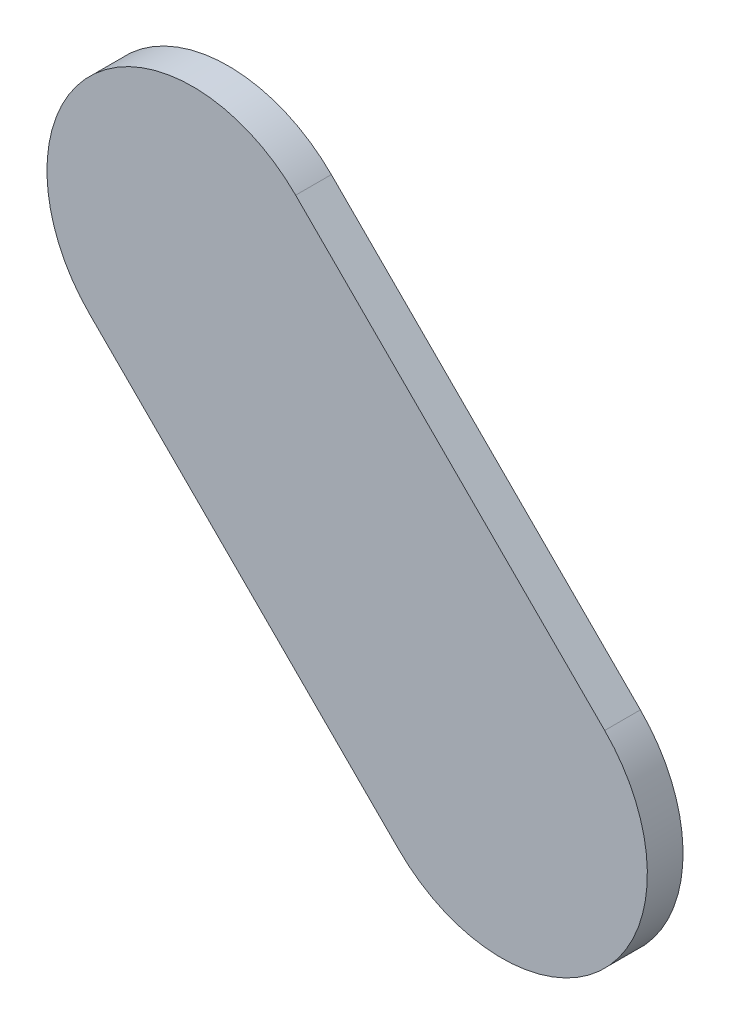
ISO-10303-21;
HEADER;
FILE_DESCRIPTION(('STEP AP214'),'2;1');
FILE_NAME('part.step','',(''),(''),'','','');
FILE_SCHEMA(('AUTOMOTIVE_DESIGN { 1 0 10303 214 1 1 1 1 }'));
ENDSEC;
DATA;
#1=APPLICATION_CONTEXT('core data for automotive mechanical design processes');
#2=APPLICATION_PROTOCOL_DEFINITION('international standard','automotive_design',2000,#1);
#3=PRODUCT_CONTEXT('',#1,'mechanical');
#4=PRODUCT('Part','Part','',(#3));
#5=PRODUCT_RELATED_PRODUCT_CATEGORY('part','',(#4));
#6=PRODUCT_DEFINITION_FORMATION('','',#4);
#7=PRODUCT_DEFINITION_CONTEXT('part definition',#1,'design');
#8=PRODUCT_DEFINITION('design','',#6,#7);
#9=PRODUCT_DEFINITION_SHAPE('','',#8);
#10=(LENGTH_UNIT() NAMED_UNIT(*) SI_UNIT(.MILLI.,.METRE.));
#11=(NAMED_UNIT(*) PLANE_ANGLE_UNIT() SI_UNIT($,.RADIAN.));
#12=(NAMED_UNIT(*) SI_UNIT($,.STERADIAN.) SOLID_ANGLE_UNIT());
#13=UNCERTAINTY_MEASURE_WITH_UNIT(LENGTH_MEASURE(1.E-05),#10,'distance_accuracy_value','');
#14=(GEOMETRIC_REPRESENTATION_CONTEXT(3) GLOBAL_UNCERTAINTY_ASSIGNED_CONTEXT((#13)) GLOBAL_UNIT_ASSIGNED_CONTEXT((#10,
#11,#12)) REPRESENTATION_CONTEXT('',''));
#15=CARTESIAN_POINT('',(0.,0.,0.));
#16=DIRECTION('',(0.,0.,1.));
#17=DIRECTION('',(1.,0.,0.));
#18=AXIS2_PLACEMENT_3D('',#15,#16,#17);
#19=CARTESIAN_POINT('',(7.897858999428,4.213768039131,0.76487));
#20=DIRECTION('',(0.,0.,-1.));
#21=DIRECTION('',(-1.,0.,0.));
#22=AXIS2_PLACEMENT_3D('',#19,#20,#21);
#23=PLANE('',#22);
#24=DIRECTION('',(0.707105987136602,-0.707107575235602,0.));
#25=VECTOR('',#24,1.);
#26=CARTESIAN_POINT('',(7.848468334001,4.460629667,0.76487));
#27=LINE('',#26,#25);
#28=CARTESIAN_POINT('',(7.84846836426741,4.4606296367336,0.76487));
#29=VERTEX_POINT('',#28);
#30=CARTESIAN_POINT('',(8.14545288933316,4.16364444466617,0.76487));
#31=VERTEX_POINT('',#30);
#32=EDGE_CURVE('E54',#29,#31,#27,.T.);
#33=ORIENTED_EDGE('',*,*,#32,.T.);
#34=CARTESIAN_POINT('',(8.046458,4.064649333,0.76487));
#35=DIRECTION('',(0.,0.,1.));
#36=DIRECTION('',(1.,0.,0.));
#37=AXIS2_PLACEMENT_3D('',#34,#35,#36);
#38=CIRCLE('',#37,0.140000072315);
#39=CARTESIAN_POINT('',(7.94746308090159,3.96565491910059,0.76487));
#40=VERTEX_POINT('',#39);
#41=EDGE_CURVE('E20',#40,#31,#38,.T.);
#42=ORIENTED_EDGE('',*,*,#41,.F.);
#43=DIRECTION('',(-0.707107575236102,0.707105987136102,0.));
#44=VECTOR('',#43,1.);
#45=CARTESIAN_POINT('',(7.947463000001,3.965655000001,0.76487));
#46=LINE('',#45,#44);
#47=CARTESIAN_POINT('',(7.65047788883361,4.26263944416655,0.76487));
#48=VERTEX_POINT('',#47);
#49=EDGE_CURVE('E78',#40,#48,#46,.T.);
#50=ORIENTED_EDGE('',*,*,#49,.T.);
#51=CARTESIAN_POINT('',(7.749472667,4.361634667,0.76487));
#52=DIRECTION('',(0.,0.,1.));
#53=DIRECTION('',(1.,0.,0.));
#54=AXIS2_PLACEMENT_3D('',#51,#52,#53);
#55=CIRCLE('',#54,0.140000072315);
#56=EDGE_CURVE('E58',#29,#48,#55,.T.);
#57=ORIENTED_EDGE('',*,*,#56,.F.);
#58=EDGE_LOOP('',(#33,#42,#50,#57));
#59=FACE_BOUND('',#58,.T.);
#60=ADVANCED_FACE('F17',(#59),#23,.T.);
#61=CARTESIAN_POINT('',(8.046458,4.064649333,0.76487));
#62=DIRECTION('',(0.,0.,1.));
#63=DIRECTION('',(1.,0.,0.));
#64=AXIS2_PLACEMENT_3D('',#61,#62,#63);
#65=CYLINDRICAL_SURFACE('',#64,0.140000072315);
#66=ORIENTED_EDGE('',*,*,#41,.T.);
#67=DIRECTION('',(0.,0.,1.));
#68=VECTOR('',#67,1.);
#69=CARTESIAN_POINT('',(8.14545266699992,4.16364466699991,0.76487));
#70=LINE('',#69,#68);
#71=CARTESIAN_POINT('',(8.14545288933321,4.16364444466625,0.79916));
#72=VERTEX_POINT('',#71);
#73=EDGE_CURVE('E62',#31,#72,#70,.T.);
#74=ORIENTED_EDGE('',*,*,#73,.T.);
#75=CARTESIAN_POINT('',(8.046458000001,4.064649898733,0.79916));
#76=DIRECTION('',(0.,0.,1.));
#77=DIRECTION('',(1.,0.,0.));
#78=AXIS2_PLACEMENT_3D('',#75,#76,#77);
#79=CIRCLE('',#78,0.14);
#80=CARTESIAN_POINT('',(7.94746308090163,3.96565491910056,0.79916));
#81=VERTEX_POINT('',#80);
#82=EDGE_CURVE('E82',#81,#72,#79,.T.);
#83=ORIENTED_EDGE('',*,*,#82,.F.);
#84=DIRECTION('',(0.,0.,1.));
#85=VECTOR('',#84,1.);
#86=CARTESIAN_POINT('',(7.947463000001,3.965655000001,0.76487));
#87=LINE('',#86,#85);
#88=EDGE_CURVE('E69',#81,#40,#87,.F.);
#89=ORIENTED_EDGE('',*,*,#88,.T.);
#90=EDGE_LOOP('',(#66,#74,#83,#89));
#91=FACE_BOUND('',#90,.T.);
#92=ADVANCED_FACE('F66',(#91),#65,.T.);
#93=CARTESIAN_POINT('',(7.848468334001,4.460629667,0.76487));
#94=DIRECTION('',(-0.707107575235602,-0.707105987136602,0.));
#95=DIRECTION('',(0.707105987136602,-0.707107575235602,0.));
#96=AXIS2_PLACEMENT_3D('',#93,#94,#95);
#97=PLANE('',#96);
#98=ORIENTED_EDGE('',*,*,#73,.F.);
#99=ORIENTED_EDGE('',*,*,#32,.F.);
#100=DIRECTION('',(0.,0.,1.));
#101=VECTOR('',#100,1.);
#102=CARTESIAN_POINT('',(7.84846833400108,4.46062966700008,0.76487));
#103=LINE('',#102,#101);
#104=CARTESIAN_POINT('',(7.84846836426739,4.46062963673362,0.79916));
#105=VERTEX_POINT('',#104);
#106=EDGE_CURVE('E73',#105,#29,#103,.F.);
#107=ORIENTED_EDGE('',*,*,#106,.F.);
#108=DIRECTION('',(-0.707105987136808,0.707107575235395,0.));
#109=VECTOR('',#108,1.);
#110=CARTESIAN_POINT('',(8.145452667,4.163644667,0.79916));
#111=LINE('',#110,#109);
#112=EDGE_CURVE('E72',#72,#105,#111,.T.);
#113=ORIENTED_EDGE('',*,*,#112,.F.);
#114=EDGE_LOOP('',(#98,#99,#107,#113));
#115=FACE_BOUND('',#114,.T.);
#116=ADVANCED_FACE('F71',(#115),#97,.F.);
#117=CARTESIAN_POINT('',(7.749472667,4.361634667,0.76487));
#118=DIRECTION('',(0.,0.,1.));
#119=DIRECTION('',(1.,0.,0.));
#120=AXIS2_PLACEMENT_3D('',#117,#118,#119);
#121=CYLINDRICAL_SURFACE('',#120,0.140000072315);
#122=ORIENTED_EDGE('',*,*,#56,.T.);
#123=DIRECTION('',(0.,0.,1.));
#124=VECTOR('',#123,1.);
#125=CARTESIAN_POINT('',(7.6504780000002,4.26263933300021,0.76487));
#126=LINE('',#125,#124);
#127=CARTESIAN_POINT('',(7.65047788883354,4.26263944416641,0.79916));
#128=VERTEX_POINT('',#127);
#129=EDGE_CURVE('E79',#48,#128,#126,.T.);
#130=ORIENTED_EDGE('',*,*,#129,.T.);
#131=CARTESIAN_POINT('',(7.749473,4.361634434268,0.79916));
#132=DIRECTION('',(0.,0.,1.));
#133=DIRECTION('',(1.,0.,0.));
#134=AXIS2_PLACEMENT_3D('',#131,#132,#133);
#135=CIRCLE('',#134,0.140000472348);
#136=EDGE_CURVE('E26',#105,#128,#135,.T.);
#137=ORIENTED_EDGE('',*,*,#136,.F.);
#138=ORIENTED_EDGE('',*,*,#106,.T.);
#139=EDGE_LOOP('',(#122,#130,#137,#138));
#140=FACE_BOUND('',#139,.T.);
#141=ADVANCED_FACE('F91',(#140),#121,.T.);
#142=CARTESIAN_POINT('',(7.947463000001,3.965655000001,0.76487));
#143=DIRECTION('',(0.707105987136102,0.707107575236102,0.));
#144=DIRECTION('',(-0.707107575236102,0.707105987136102,0.));
#145=AXIS2_PLACEMENT_3D('',#142,#143,#144);
#146=PLANE('',#145);
#147=ORIENTED_EDGE('',*,*,#129,.F.);
#148=ORIENTED_EDGE('',*,*,#49,.F.);
#149=ORIENTED_EDGE('',*,*,#88,.F.);
#150=DIRECTION('',(0.707107575236589,-0.707105987135614,0.));
#151=VECTOR('',#150,1.);
#152=CARTESIAN_POINT('',(7.650478,4.262639333,0.79916));
#153=LINE('',#152,#151);
#154=EDGE_CURVE('E11',#128,#81,#153,.T.);
#155=ORIENTED_EDGE('',*,*,#154,.F.);
#156=EDGE_LOOP('',(#147,#148,#149,#155));
#157=FACE_BOUND('',#156,.T.);
#158=ADVANCED_FACE('F90',(#157),#146,.F.);
#159=CARTESIAN_POINT('',(7.897858999428,4.213768039131,0.79916));
#160=DIRECTION('',(0.,0.,1.));
#161=DIRECTION('',(1.,0.,0.));
#162=AXIS2_PLACEMENT_3D('',#159,#160,#161);
#163=PLANE('',#162);
#164=ORIENTED_EDGE('',*,*,#136,.T.);
#165=ORIENTED_EDGE('',*,*,#154,.T.);
#166=ORIENTED_EDGE('',*,*,#82,.T.);
#167=ORIENTED_EDGE('',*,*,#112,.T.);
#168=EDGE_LOOP('',(#164,#165,#166,#167));
#169=FACE_BOUND('',#168,.T.);
#170=ADVANCED_FACE('F87',(#169),#163,.T.);
#171=CLOSED_SHELL('',(#60,#92,#116,#141,#158,#170));
#172=MANIFOLD_SOLID_BREP('B1',#171);
#173=ADVANCED_BREP_SHAPE_REPRESENTATION('',(#18,#172),#14);
#174=SHAPE_DEFINITION_REPRESENTATION(#9,#173);
ENDSEC;
END-ISO-10303-21;
